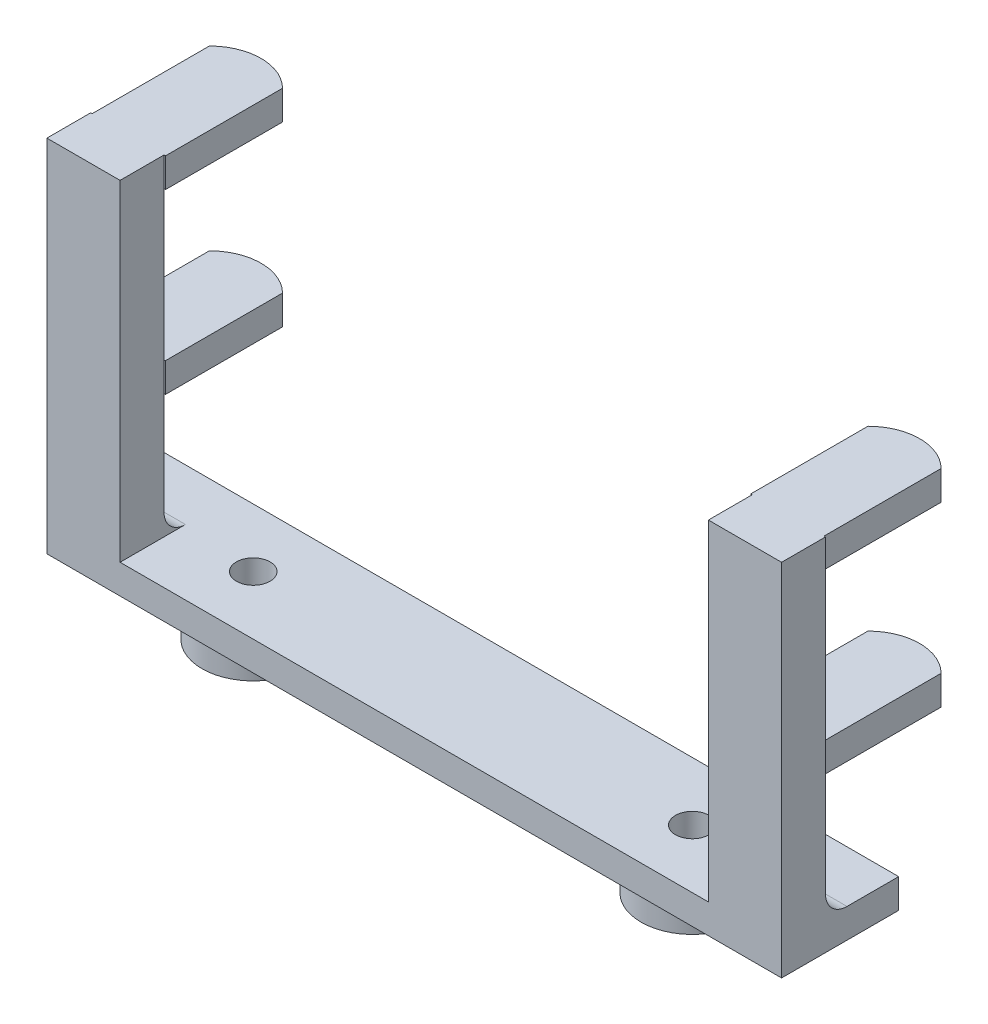
ISO-10303-21;
HEADER;
FILE_DESCRIPTION(('STEP AP214'),'2;1');
FILE_NAME('part.step','',(''),(''),'','','');
FILE_SCHEMA(('AUTOMOTIVE_DESIGN { 1 0 10303 214 1 1 1 1 }'));
ENDSEC;
DATA;
#1=APPLICATION_CONTEXT('core data for automotive mechanical design processes');
#2=APPLICATION_PROTOCOL_DEFINITION('international standard','automotive_design',2000,#1);
#3=PRODUCT_CONTEXT('',#1,'mechanical');
#4=PRODUCT('Part','Part','',(#3));
#5=PRODUCT_RELATED_PRODUCT_CATEGORY('part','',(#4));
#6=PRODUCT_DEFINITION_FORMATION('','',#4);
#7=PRODUCT_DEFINITION_CONTEXT('part definition',#1,'design');
#8=PRODUCT_DEFINITION('design','',#6,#7);
#9=PRODUCT_DEFINITION_SHAPE('','',#8);
#10=(LENGTH_UNIT() NAMED_UNIT(*) SI_UNIT(.MILLI.,.METRE.));
#11=(NAMED_UNIT(*) PLANE_ANGLE_UNIT() SI_UNIT($,.RADIAN.));
#12=(NAMED_UNIT(*) SI_UNIT($,.STERADIAN.) SOLID_ANGLE_UNIT());
#13=UNCERTAINTY_MEASURE_WITH_UNIT(LENGTH_MEASURE(1.E-05),#10,'distance_accuracy_value','');
#14=(GEOMETRIC_REPRESENTATION_CONTEXT(3) GLOBAL_UNCERTAINTY_ASSIGNED_CONTEXT((#13)) GLOBAL_UNIT_ASSIGNED_CONTEXT((#10,
#11,#12)) REPRESENTATION_CONTEXT('',''));
#15=CARTESIAN_POINT('',(0.,0.,0.));
#16=DIRECTION('',(0.,0.,1.));
#17=DIRECTION('',(1.,0.,0.));
#18=AXIS2_PLACEMENT_3D('',#15,#16,#17);
#19=CARTESIAN_POINT('',(-31.877,-2.54000000000001,10.16));
#20=DIRECTION('',(0.,1.,0.));
#21=DIRECTION('',(0.,0.,1.));
#22=AXIS2_PLACEMENT_3D('',#19,#20,#21);
#23=PLANE('',#22);
#24=CARTESIAN_POINT('',(-19.05,-2.54000000000001,5.08));
#25=DIRECTION('',(0.,1.,0.));
#26=DIRECTION('',(0.,0.,1.));
#27=AXIS2_PLACEMENT_3D('',#24,#25,#26);
#28=CIRCLE('',#27,4.445);
#29=CARTESIAN_POINT('',(-19.05,-2.54000000000001,9.525));
#30=VERTEX_POINT('',#29);
#31=EDGE_CURVE('E42',#30,#30,#28,.F.);
#32=ORIENTED_EDGE('',*,*,#31,.F.);
#33=EDGE_LOOP('',(#32));
#34=FACE_BOUND('',#33,.T.);
#35=DIRECTION('',(1.,0.,0.));
#36=VECTOR('',#35,1.);
#37=CARTESIAN_POINT('',(-31.877,-2.54000000000001,0.));
#38=LINE('',#37,#36);
#39=CARTESIAN_POINT('',(-31.877,-2.54000000000001,0.));
#40=VERTEX_POINT('',#39);
#41=CARTESIAN_POINT('',(31.877,-2.54000000000001,0.));
#42=VERTEX_POINT('',#41);
#43=EDGE_CURVE('E442',#40,#42,#38,.T.);
#44=ORIENTED_EDGE('',*,*,#43,.T.);
#45=DIRECTION('',(0.,0.,-1.));
#46=VECTOR('',#45,1.);
#47=CARTESIAN_POINT('',(31.877,-2.54000000000001,10.16));
#48=LINE('',#47,#46);
#49=CARTESIAN_POINT('',(31.877,-2.54000000000001,10.16));
#50=VERTEX_POINT('',#49);
#51=EDGE_CURVE('E458',#50,#42,#48,.T.);
#52=ORIENTED_EDGE('',*,*,#51,.F.);
#53=DIRECTION('',(1.,0.,0.));
#54=VECTOR('',#53,1.);
#55=CARTESIAN_POINT('',(-31.877,-2.54000000000001,10.16));
#56=LINE('',#55,#54);
#57=CARTESIAN_POINT('',(-31.877,-2.54000000000001,10.16));
#58=VERTEX_POINT('',#57);
#59=EDGE_CURVE('E430',#58,#50,#56,.T.);
#60=ORIENTED_EDGE('',*,*,#59,.F.);
#61=DIRECTION('',(0.,0.,-1.));
#62=VECTOR('',#61,1.);
#63=CARTESIAN_POINT('',(-31.877,-2.54000000000001,10.16));
#64=LINE('',#63,#62);
#65=EDGE_CURVE('E461',#58,#40,#64,.T.);
#66=ORIENTED_EDGE('',*,*,#65,.T.);
#67=EDGE_LOOP('',(#44,#52,#60,#66));
#68=FACE_BOUND('',#67,.T.);
#69=CARTESIAN_POINT('',(19.05,-2.54000000000001,5.08));
#70=DIRECTION('',(0.,1.,0.));
#71=DIRECTION('',(0.,0.,1.));
#72=AXIS2_PLACEMENT_3D('',#69,#70,#71);
#73=CIRCLE('',#72,4.445);
#74=CARTESIAN_POINT('',(19.05,-2.54000000000001,9.525));
#75=VERTEX_POINT('',#74);
#76=EDGE_CURVE('E11',#75,#75,#73,.F.);
#77=ORIENTED_EDGE('',*,*,#76,.F.);
#78=EDGE_LOOP('',(#77));
#79=FACE_BOUND('',#78,.T.);
#80=ADVANCED_FACE('F34',(#34,#68,#79),#23,.F.);
#81=CARTESIAN_POINT('',(-31.877,28.702,6.35));
#82=DIRECTION('',(0.,0.,1.));
#83=DIRECTION('',(0.,-1.,0.));
#84=AXIS2_PLACEMENT_3D('',#81,#82,#83);
#85=PLANE('',#84);
#86=DIRECTION('',(0.,-1.,0.));
#87=VECTOR('',#86,1.);
#88=CARTESIAN_POINT('',(31.75,13.3096,6.35));
#89=LINE('',#88,#87);
#90=CARTESIAN_POINT('',(31.75,13.3096,6.35));
#91=VERTEX_POINT('',#90);
#92=CARTESIAN_POINT('',(31.75,10.7696,6.35));
#93=VERTEX_POINT('',#92);
#94=EDGE_CURVE('E279',#91,#93,#89,.T.);
#95=ORIENTED_EDGE('',*,*,#94,.F.);
#96=DIRECTION('',(-1.,0.,0.));
#97=VECTOR('',#96,1.);
#98=CARTESIAN_POINT('',(31.75,13.3096,6.35));
#99=LINE('',#98,#97);
#100=CARTESIAN_POINT('',(25.527,13.3096,6.35));
#101=VERTEX_POINT('',#100);
#102=EDGE_CURVE('E249',#91,#101,#99,.T.);
#103=ORIENTED_EDGE('',*,*,#102,.T.);
#104=DIRECTION('',(0.,-1.,0.));
#105=VECTOR('',#104,1.);
#106=CARTESIAN_POINT('',(25.527,0.,6.35));
#107=LINE('',#106,#105);
#108=CARTESIAN_POINT('',(25.527,26.162,6.35));
#109=VERTEX_POINT('',#108);
#110=EDGE_CURVE('E473',#109,#101,#107,.T.);
#111=ORIENTED_EDGE('',*,*,#110,.F.);
#112=DIRECTION('',(-1.,0.,0.));
#113=VECTOR('',#112,1.);
#114=CARTESIAN_POINT('',(31.75,26.162,6.35));
#115=LINE('',#114,#113);
#116=CARTESIAN_POINT('',(31.75,26.162,6.35));
#117=VERTEX_POINT('',#116);
#118=EDGE_CURVE('E57',#117,#109,#115,.T.);
#119=ORIENTED_EDGE('',*,*,#118,.F.);
#120=DIRECTION('',(0.,1.,0.));
#121=VECTOR('',#120,1.);
#122=CARTESIAN_POINT('',(31.75,26.162,6.35));
#123=LINE('',#122,#121);
#124=CARTESIAN_POINT('',(31.75,28.702,6.35));
#125=VERTEX_POINT('',#124);
#126=EDGE_CURVE('E293',#117,#125,#123,.T.);
#127=ORIENTED_EDGE('',*,*,#126,.T.);
#128=DIRECTION('',(1.,0.,0.));
#129=VECTOR('',#128,1.);
#130=CARTESIAN_POINT('',(-31.877,28.702,6.35));
#131=LINE('',#130,#129);
#132=CARTESIAN_POINT('',(31.877,28.702,6.35));
#133=VERTEX_POINT('',#132);
#134=EDGE_CURVE('E389',#125,#133,#131,.T.);
#135=ORIENTED_EDGE('',*,*,#134,.T.);
#136=DIRECTION('',(0.,-1.,0.));
#137=VECTOR('',#136,1.);
#138=CARTESIAN_POINT('',(31.877,28.702,6.35));
#139=LINE('',#138,#137);
#140=CARTESIAN_POINT('',(31.877,1.86741665164273,6.35));
#141=VERTEX_POINT('',#140);
#142=EDGE_CURVE('E390',#133,#141,#139,.T.);
#143=ORIENTED_EDGE('',*,*,#142,.T.);
#144=DIRECTION('',(1.,0.,0.));
#145=VECTOR('',#144,1.);
#146=CARTESIAN_POINT('',(-31.877,1.86741665164274,6.35));
#147=LINE('',#146,#145);
#148=CARTESIAN_POINT('',(25.527,1.86741665164273,6.35));
#149=VERTEX_POINT('',#148);
#150=EDGE_CURVE('E407',#149,#141,#147,.T.);
#151=ORIENTED_EDGE('',*,*,#150,.F.);
#152=CARTESIAN_POINT('',(25.527,10.7696,6.35));
#153=VERTEX_POINT('',#152);
#154=EDGE_CURVE('E469',#153,#149,#107,.T.);
#155=ORIENTED_EDGE('',*,*,#154,.F.);
#156=DIRECTION('',(-1.,0.,0.));
#157=VECTOR('',#156,1.);
#158=CARTESIAN_POINT('',(31.75,10.7696,6.35));
#159=LINE('',#158,#157);
#160=EDGE_CURVE('E49',#93,#153,#159,.T.);
#161=ORIENTED_EDGE('',*,*,#160,.F.);
#162=EDGE_LOOP('',(#95,#103,#111,#119,#127,#135,#143,#151,#155,#161));
#163=FACE_BOUND('',#162,.T.);
#164=ADVANCED_FACE('F484',(#163),#85,.F.);
#165=CARTESIAN_POINT('',(-25.527,0.,10.16));
#166=DIRECTION('',(-1.,0.,0.));
#167=DIRECTION('',(0.,0.,1.));
#168=AXIS2_PLACEMENT_3D('',#165,#166,#167);
#169=PLANE('',#168);
#170=DIRECTION('',(0.,0.,-1.));
#171=VECTOR('',#170,1.);
#172=CARTESIAN_POINT('',(-25.527,0.,10.16));
#173=LINE('',#172,#171);
#174=CARTESIAN_POINT('',(-25.527,0.,10.16));
#175=VERTEX_POINT('',#174);
#176=CARTESIAN_POINT('',(-25.527,0.,4.48258334835726));
#177=VERTEX_POINT('',#176);
#178=EDGE_CURVE('E440',#175,#177,#173,.T.);
#179=ORIENTED_EDGE('',*,*,#178,.T.);
#180=CARTESIAN_POINT('',(-25.527,1.86741665164274,4.48258334835726));
#181=DIRECTION('',(-1.,0.,0.));
#182=DIRECTION('',(0.,0.,1.));
#183=AXIS2_PLACEMENT_3D('',#180,#181,#182);
#184=CIRCLE('',#183,1.86741665164274);
#185=CARTESIAN_POINT('',(-25.527,1.86741665164274,6.35));
#186=VERTEX_POINT('',#185);
#187=EDGE_CURVE('E412',#177,#186,#184,.T.);
#188=ORIENTED_EDGE('',*,*,#187,.T.);
#189=DIRECTION('',(0.,1.,0.));
#190=VECTOR('',#189,1.);
#191=CARTESIAN_POINT('',(-25.527,0.,6.35));
#192=LINE('',#191,#190);
#193=CARTESIAN_POINT('',(-25.527,10.7696,6.35));
#194=VERTEX_POINT('',#193);
#195=EDGE_CURVE('E416',#186,#194,#192,.T.);
#196=ORIENTED_EDGE('',*,*,#195,.T.);
#197=CARTESIAN_POINT('',(-25.527,13.3096,6.35));
#198=VERTEX_POINT('',#197);
#199=EDGE_CURVE('E420',#194,#198,#192,.T.);
#200=ORIENTED_EDGE('',*,*,#199,.T.);
#201=CARTESIAN_POINT('',(-25.527,26.162,6.35));
#202=VERTEX_POINT('',#201);
#203=EDGE_CURVE('E421',#198,#202,#192,.T.);
#204=ORIENTED_EDGE('',*,*,#203,.T.);
#205=CARTESIAN_POINT('',(-25.527,28.702,6.35));
#206=VERTEX_POINT('',#205);
#207=EDGE_CURVE('E415',#202,#206,#192,.T.);
#208=ORIENTED_EDGE('',*,*,#207,.T.);
#209=DIRECTION('',(0.,0.,-1.));
#210=VECTOR('',#209,1.);
#211=CARTESIAN_POINT('',(-25.527,28.702,10.16));
#212=LINE('',#211,#210);
#213=CARTESIAN_POINT('',(-25.527,28.702,10.16));
#214=VERTEX_POINT('',#213);
#215=EDGE_CURVE('E467',#214,#206,#212,.T.);
#216=ORIENTED_EDGE('',*,*,#215,.F.);
#217=DIRECTION('',(0.,1.,0.));
#218=VECTOR('',#217,1.);
#219=CARTESIAN_POINT('',(-25.527,0.,10.16));
#220=LINE('',#219,#218);
#221=EDGE_CURVE('E422',#175,#214,#220,.T.);
#222=ORIENTED_EDGE('',*,*,#221,.F.);
#223=EDGE_LOOP('',(#179,#188,#196,#200,#204,#208,#216,#222));
#224=FACE_BOUND('',#223,.T.);
#225=ADVANCED_FACE('F36',(#224),#169,.F.);
#226=CARTESIAN_POINT('',(-25.527,28.702,10.16));
#227=DIRECTION('',(0.,-1.,0.));
#228=DIRECTION('',(0.,0.,-1.));
#229=AXIS2_PLACEMENT_3D('',#226,#227,#228);
#230=PLANE('',#229);
#231=ORIENTED_EDGE('',*,*,#215,.T.);
#232=DIRECTION('',(1.,0.,0.));
#233=VECTOR('',#232,1.);
#234=CARTESIAN_POINT('',(-31.75,28.702,6.35));
#235=LINE('',#234,#233);
#236=CARTESIAN_POINT('',(-25.4,28.702,6.35));
#237=VERTEX_POINT('',#236);
#238=EDGE_CURVE('E337',#206,#237,#235,.T.);
#239=ORIENTED_EDGE('',*,*,#238,.T.);
#240=DIRECTION('',(0.,0.,-1.));
#241=VECTOR('',#240,1.);
#242=CARTESIAN_POINT('',(-25.4,28.702,6.35));
#243=LINE('',#242,#241);
#244=CARTESIAN_POINT('',(-25.4,28.702,-3.81));
#245=VERTEX_POINT('',#244);
#246=EDGE_CURVE('E360',#237,#245,#243,.T.);
#247=ORIENTED_EDGE('',*,*,#246,.T.);
#248=CARTESIAN_POINT('',(-28.575,28.702,-0.634999999999999));
#249=DIRECTION('',(0.,1.,0.));
#250=DIRECTION('',(0.,0.,-1.));
#251=AXIS2_PLACEMENT_3D('',#248,#249,#250);
#252=CIRCLE('',#251,4.49012806053458);
#253=CARTESIAN_POINT('',(-31.75,28.702,-3.81));
#254=VERTEX_POINT('',#253);
#255=EDGE_CURVE('E363',#245,#254,#252,.T.);
#256=ORIENTED_EDGE('',*,*,#255,.T.);
#257=DIRECTION('',(0.,0.,1.));
#258=VECTOR('',#257,1.);
#259=CARTESIAN_POINT('',(-31.75,28.702,6.35));
#260=LINE('',#259,#258);
#261=CARTESIAN_POINT('',(-31.75,28.702,6.35));
#262=VERTEX_POINT('',#261);
#263=EDGE_CURVE('E366',#254,#262,#260,.T.);
#264=ORIENTED_EDGE('',*,*,#263,.T.);
#265=CARTESIAN_POINT('',(-31.877,28.702,6.35));
#266=VERTEX_POINT('',#265);
#267=EDGE_CURVE('E408',#266,#262,#131,.T.);
#268=ORIENTED_EDGE('',*,*,#267,.F.);
#269=DIRECTION('',(0.,0.,-1.));
#270=VECTOR('',#269,1.);
#271=CARTESIAN_POINT('',(-31.877,28.702,10.16));
#272=LINE('',#271,#270);
#273=CARTESIAN_POINT('',(-31.877,28.702,10.16));
#274=VERTEX_POINT('',#273);
#275=EDGE_CURVE('E464',#274,#266,#272,.T.);
#276=ORIENTED_EDGE('',*,*,#275,.F.);
#277=DIRECTION('',(-1.,0.,0.));
#278=VECTOR('',#277,1.);
#279=CARTESIAN_POINT('',(-25.527,28.702,10.16));
#280=LINE('',#279,#278);
#281=EDGE_CURVE('E425',#214,#274,#280,.T.);
#282=ORIENTED_EDGE('',*,*,#281,.F.);
#283=EDGE_LOOP('',(#231,#239,#247,#256,#264,#268,#276,#282));
#284=FACE_BOUND('',#283,.T.);
#285=ADVANCED_FACE('F634',(#284),#230,.F.);
#286=CARTESIAN_POINT('',(-31.877,28.702,10.16));
#287=DIRECTION('',(1.,0.,0.));
#288=DIRECTION('',(0.,1.,0.));
#289=AXIS2_PLACEMENT_3D('',#286,#287,#288);
#290=PLANE('',#289);
#291=CARTESIAN_POINT('',(-31.877,1.86741665164274,4.48258334835726));
#292=DIRECTION('',(1.,0.,0.));
#293=DIRECTION('',(0.,1.,0.));
#294=AXIS2_PLACEMENT_3D('',#291,#292,#293);
#295=CIRCLE('',#294,1.86741665164274);
#296=CARTESIAN_POINT('',(-31.877,1.86741665164274,6.35));
#297=VERTEX_POINT('',#296);
#298=CARTESIAN_POINT('',(-31.877,0.,4.48258334835726));
#299=VERTEX_POINT('',#298);
#300=EDGE_CURVE('E382',#297,#299,#295,.T.);
#301=ORIENTED_EDGE('',*,*,#300,.T.);
#302=DIRECTION('',(0.,0.,-1.));
#303=VECTOR('',#302,1.);
#304=CARTESIAN_POINT('',(-31.877,0.,4.48258334835726));
#305=LINE('',#304,#303);
#306=CARTESIAN_POINT('',(-31.877,0.,0.));
#307=VERTEX_POINT('',#306);
#308=EDGE_CURVE('E386',#299,#307,#305,.T.);
#309=ORIENTED_EDGE('',*,*,#308,.T.);
#310=DIRECTION('',(0.,-1.,0.));
#311=VECTOR('',#310,1.);
#312=CARTESIAN_POINT('',(-31.877,28.702,0.));
#313=LINE('',#312,#311);
#314=EDGE_CURVE('E419',#307,#40,#313,.T.);
#315=ORIENTED_EDGE('',*,*,#314,.T.);
#316=ORIENTED_EDGE('',*,*,#65,.F.);
#317=DIRECTION('',(0.,-1.,0.));
#318=VECTOR('',#317,1.);
#319=CARTESIAN_POINT('',(-31.877,28.702,10.16));
#320=LINE('',#319,#318);
#321=EDGE_CURVE('E428',#274,#58,#320,.T.);
#322=ORIENTED_EDGE('',*,*,#321,.F.);
#323=ORIENTED_EDGE('',*,*,#275,.T.);
#324=DIRECTION('',(0.,-1.,0.));
#325=VECTOR('',#324,1.);
#326=CARTESIAN_POINT('',(-31.877,28.702,6.35));
#327=LINE('',#326,#325);
#328=EDGE_CURVE('E379',#266,#297,#327,.T.);
#329=ORIENTED_EDGE('',*,*,#328,.T.);
#330=EDGE_LOOP('',(#301,#309,#315,#316,#322,#323,#329));
#331=FACE_BOUND('',#330,.T.);
#332=ADVANCED_FACE('F630',(#331),#290,.F.);
#333=CARTESIAN_POINT('',(31.877,28.702,10.16));
#334=DIRECTION('',(-1.,0.,0.));
#335=DIRECTION('',(0.,-1.,0.));
#336=AXIS2_PLACEMENT_3D('',#333,#334,#335);
#337=PLANE('',#336);
#338=DIRECTION('',(0.,1.,0.));
#339=VECTOR('',#338,1.);
#340=CARTESIAN_POINT('',(31.877,28.702,0.));
#341=LINE('',#340,#339);
#342=CARTESIAN_POINT('',(31.877,0.,0.));
#343=VERTEX_POINT('',#342);
#344=EDGE_CURVE('E444',#42,#343,#341,.T.);
#345=ORIENTED_EDGE('',*,*,#344,.T.);
#346=DIRECTION('',(0.,0.,-1.));
#347=VECTOR('',#346,1.);
#348=CARTESIAN_POINT('',(31.877,0.,4.48258334835726));
#349=LINE('',#348,#347);
#350=CARTESIAN_POINT('',(31.877,0.,4.48258334835726));
#351=VERTEX_POINT('',#350);
#352=EDGE_CURVE('E383',#351,#343,#349,.T.);
#353=ORIENTED_EDGE('',*,*,#352,.F.);
#354=CARTESIAN_POINT('',(31.877,1.86741665164273,4.48258334835726));
#355=DIRECTION('',(1.,0.,0.));
#356=DIRECTION('',(0.,1.,0.));
#357=AXIS2_PLACEMENT_3D('',#354,#355,#356);
#358=CIRCLE('',#357,1.86741665164274);
#359=EDGE_CURVE('E393',#141,#351,#358,.T.);
#360=ORIENTED_EDGE('',*,*,#359,.F.);
#361=ORIENTED_EDGE('',*,*,#142,.F.);
#362=DIRECTION('',(0.,0.,-1.));
#363=VECTOR('',#362,1.);
#364=CARTESIAN_POINT('',(31.877,28.702,10.16));
#365=LINE('',#364,#363);
#366=CARTESIAN_POINT('',(31.877,28.702,10.16));
#367=VERTEX_POINT('',#366);
#368=EDGE_CURVE('E455',#367,#133,#365,.T.);
#369=ORIENTED_EDGE('',*,*,#368,.F.);
#370=DIRECTION('',(0.,1.,0.));
#371=VECTOR('',#370,1.);
#372=CARTESIAN_POINT('',(31.877,28.702,10.16));
#373=LINE('',#372,#371);
#374=EDGE_CURVE('E432',#50,#367,#373,.T.);
#375=ORIENTED_EDGE('',*,*,#374,.F.);
#376=ORIENTED_EDGE('',*,*,#51,.T.);
#377=EDGE_LOOP('',(#345,#353,#360,#361,#369,#375,#376));
#378=FACE_BOUND('',#377,.T.);
#379=ADVANCED_FACE('F627',(#378),#337,.F.);
#380=CARTESIAN_POINT('',(25.527,28.702,10.16));
#381=DIRECTION('',(0.,-1.,0.));
#382=DIRECTION('',(0.,0.,-1.));
#383=AXIS2_PLACEMENT_3D('',#380,#381,#382);
#384=PLANE('',#383);
#385=ORIENTED_EDGE('',*,*,#368,.T.);
#386=ORIENTED_EDGE('',*,*,#134,.F.);
#387=DIRECTION('',(0.,0.,1.));
#388=VECTOR('',#387,1.);
#389=CARTESIAN_POINT('',(31.75,28.702,6.35));
#390=LINE('',#389,#388);
#391=CARTESIAN_POINT('',(31.75,28.702,-3.81));
#392=VERTEX_POINT('',#391);
#393=EDGE_CURVE('E295',#392,#125,#390,.T.);
#394=ORIENTED_EDGE('',*,*,#393,.F.);
#395=CARTESIAN_POINT('',(28.575,28.702,-0.634999999999999));
#396=DIRECTION('',(0.,-1.,0.));
#397=DIRECTION('',(0.,0.,-1.));
#398=AXIS2_PLACEMENT_3D('',#395,#396,#397);
#399=CIRCLE('',#398,4.49012806053458);
#400=CARTESIAN_POINT('',(25.4,28.702,-3.81));
#401=VERTEX_POINT('',#400);
#402=EDGE_CURVE('E298',#401,#392,#399,.T.);
#403=ORIENTED_EDGE('',*,*,#402,.F.);
#404=DIRECTION('',(0.,0.,-1.));
#405=VECTOR('',#404,1.);
#406=CARTESIAN_POINT('',(25.4,28.702,6.35));
#407=LINE('',#406,#405);
#408=CARTESIAN_POINT('',(25.4,28.702,6.35));
#409=VERTEX_POINT('',#408);
#410=EDGE_CURVE('E300',#409,#401,#407,.T.);
#411=ORIENTED_EDGE('',*,*,#410,.F.);
#412=DIRECTION('',(-1.,0.,0.));
#413=VECTOR('',#412,1.);
#414=CARTESIAN_POINT('',(31.75,28.702,6.35));
#415=LINE('',#414,#413);
#416=CARTESIAN_POINT('',(25.527,28.702,6.35));
#417=VERTEX_POINT('',#416);
#418=EDGE_CURVE('E281',#417,#409,#415,.T.);
#419=ORIENTED_EDGE('',*,*,#418,.F.);
#420=DIRECTION('',(0.,0.,-1.));
#421=VECTOR('',#420,1.);
#422=CARTESIAN_POINT('',(25.527,28.702,10.16));
#423=LINE('',#422,#421);
#424=CARTESIAN_POINT('',(25.527,28.702,10.16));
#425=VERTEX_POINT('',#424);
#426=EDGE_CURVE('E453',#425,#417,#423,.T.);
#427=ORIENTED_EDGE('',*,*,#426,.F.);
#428=DIRECTION('',(-1.,0.,0.));
#429=VECTOR('',#428,1.);
#430=CARTESIAN_POINT('',(25.527,28.702,10.16));
#431=LINE('',#430,#429);
#432=EDGE_CURVE('E434',#367,#425,#431,.T.);
#433=ORIENTED_EDGE('',*,*,#432,.F.);
#434=EDGE_LOOP('',(#385,#386,#394,#403,#411,#419,#427,#433));
#435=FACE_BOUND('',#434,.T.);
#436=ADVANCED_FACE('F623',(#435),#384,.F.);
#437=CARTESIAN_POINT('',(25.527,0.,10.16));
#438=DIRECTION('',(1.,0.,0.));
#439=DIRECTION('',(0.,0.,-1.));
#440=AXIS2_PLACEMENT_3D('',#437,#438,#439);
#441=PLANE('',#440);
#442=EDGE_CURVE('E470',#417,#109,#107,.T.);
#443=ORIENTED_EDGE('',*,*,#442,.T.);
#444=ORIENTED_EDGE('',*,*,#110,.T.);
#445=EDGE_CURVE('E245',#101,#153,#107,.T.);
#446=ORIENTED_EDGE('',*,*,#445,.T.);
#447=ORIENTED_EDGE('',*,*,#154,.T.);
#448=CARTESIAN_POINT('',(25.527,1.86741665164273,4.48258334835726));
#449=DIRECTION('',(1.,0.,0.));
#450=DIRECTION('',(0.,0.,-1.));
#451=AXIS2_PLACEMENT_3D('',#448,#449,#450);
#452=CIRCLE('',#451,1.86741665164274);
#453=CARTESIAN_POINT('',(25.527,0.,4.48258334835726));
#454=VERTEX_POINT('',#453);
#455=EDGE_CURVE('E402',#149,#454,#452,.T.);
#456=ORIENTED_EDGE('',*,*,#455,.T.);
#457=DIRECTION('',(0.,0.,-1.));
#458=VECTOR('',#457,1.);
#459=CARTESIAN_POINT('',(25.527,0.,10.16));
#460=LINE('',#459,#458);
#461=CARTESIAN_POINT('',(25.527,0.,10.16));
#462=VERTEX_POINT('',#461);
#463=EDGE_CURVE('E450',#462,#454,#460,.T.);
#464=ORIENTED_EDGE('',*,*,#463,.F.);
#465=DIRECTION('',(0.,-1.,0.));
#466=VECTOR('',#465,1.);
#467=CARTESIAN_POINT('',(25.527,0.,10.16));
#468=LINE('',#467,#466);
#469=EDGE_CURVE('E436',#425,#462,#468,.T.);
#470=ORIENTED_EDGE('',*,*,#469,.F.);
#471=ORIENTED_EDGE('',*,*,#426,.T.);
#472=EDGE_LOOP('',(#443,#444,#446,#447,#456,#464,#470,#471));
#473=FACE_BOUND('',#472,.T.);
#474=ADVANCED_FACE('F619',(#473),#441,.F.);
#475=CARTESIAN_POINT('',(25.527,0.,10.16));
#476=DIRECTION('',(0.,-1.,0.));
#477=DIRECTION('',(0.,0.,-1.));
#478=AXIS2_PLACEMENT_3D('',#475,#476,#477);
#479=PLANE('',#478);
#480=CARTESIAN_POINT('',(19.05,0.,5.08));
#481=DIRECTION('',(0.,-1.,0.));
#482=DIRECTION('',(0.,0.,-1.));
#483=AXIS2_PLACEMENT_3D('',#480,#481,#482);
#484=CIRCLE('',#483,1.4605);
#485=CARTESIAN_POINT('',(19.05,0.,3.6195));
#486=VERTEX_POINT('',#485);
#487=EDGE_CURVE('E372',#486,#486,#484,.T.);
#488=ORIENTED_EDGE('',*,*,#487,.T.);
#489=EDGE_LOOP('',(#488));
#490=FACE_BOUND('',#489,.T.);
#491=CARTESIAN_POINT('',(-19.05,0.,5.08));
#492=DIRECTION('',(0.,-1.,0.));
#493=DIRECTION('',(0.,0.,-1.));
#494=AXIS2_PLACEMENT_3D('',#491,#492,#493);
#495=CIRCLE('',#494,1.4605);
#496=CARTESIAN_POINT('',(-19.05,0.,3.6195));
#497=VERTEX_POINT('',#496);
#498=EDGE_CURVE('E394',#497,#497,#495,.T.);
#499=ORIENTED_EDGE('',*,*,#498,.T.);
#500=EDGE_LOOP('',(#499));
#501=FACE_BOUND('',#500,.T.);
#502=DIRECTION('',(-1.,0.,0.));
#503=VECTOR('',#502,1.);
#504=CARTESIAN_POINT('',(25.527,0.,0.));
#505=LINE('',#504,#503);
#506=EDGE_CURVE('E426',#343,#307,#505,.T.);
#507=ORIENTED_EDGE('',*,*,#506,.T.);
#508=ORIENTED_EDGE('',*,*,#308,.F.);
#509=DIRECTION('',(1.,0.,0.));
#510=VECTOR('',#509,1.);
#511=CARTESIAN_POINT('',(-31.877,0.,4.48258334835726));
#512=LINE('',#511,#510);
#513=EDGE_CURVE('E399',#299,#177,#512,.T.);
#514=ORIENTED_EDGE('',*,*,#513,.T.);
#515=ORIENTED_EDGE('',*,*,#178,.F.);
#516=DIRECTION('',(-1.,0.,0.));
#517=VECTOR('',#516,1.);
#518=CARTESIAN_POINT('',(25.527,0.,10.16));
#519=LINE('',#518,#517);
#520=EDGE_CURVE('E438',#462,#175,#519,.T.);
#521=ORIENTED_EDGE('',*,*,#520,.F.);
#522=ORIENTED_EDGE('',*,*,#463,.T.);
#523=EDGE_CURVE('E403',#454,#351,#512,.T.);
#524=ORIENTED_EDGE('',*,*,#523,.T.);
#525=ORIENTED_EDGE('',*,*,#352,.T.);
#526=EDGE_LOOP('',(#507,#508,#514,#515,#521,#522,#524,#525));
#527=FACE_BOUND('',#526,.T.);
#528=ADVANCED_FACE('F612',(#490,#501,#527),#479,.F.);
#529=CARTESIAN_POINT('',(0.,0.,10.16));
#530=DIRECTION('',(0.,0.,1.));
#531=DIRECTION('',(1.,0.,0.));
#532=AXIS2_PLACEMENT_3D('',#529,#530,#531);
#533=PLANE('',#532);
#534=ORIENTED_EDGE('',*,*,#221,.T.);
#535=ORIENTED_EDGE('',*,*,#281,.T.);
#536=ORIENTED_EDGE('',*,*,#321,.T.);
#537=ORIENTED_EDGE('',*,*,#59,.T.);
#538=ORIENTED_EDGE('',*,*,#374,.T.);
#539=ORIENTED_EDGE('',*,*,#432,.T.);
#540=ORIENTED_EDGE('',*,*,#469,.T.);
#541=ORIENTED_EDGE('',*,*,#520,.T.);
#542=EDGE_LOOP('',(#534,#535,#536,#537,#538,#539,#540,#541));
#543=FACE_BOUND('',#542,.T.);
#544=ADVANCED_FACE('F608',(#543),#533,.T.);
#545=CARTESIAN_POINT('',(0.,0.,0.));
#546=DIRECTION('',(0.,0.,1.));
#547=DIRECTION('',(1.,0.,0.));
#548=AXIS2_PLACEMENT_3D('',#545,#546,#547);
#549=PLANE('',#548);
#550=ORIENTED_EDGE('',*,*,#314,.F.);
#551=ORIENTED_EDGE('',*,*,#506,.F.);
#552=ORIENTED_EDGE('',*,*,#344,.F.);
#553=ORIENTED_EDGE('',*,*,#43,.F.);
#554=EDGE_LOOP('',(#550,#551,#552,#553));
#555=FACE_BOUND('',#554,.T.);
#556=ADVANCED_FACE('F611',(#555),#549,.F.);
#557=CARTESIAN_POINT('',(-31.877,1.86741665164274,4.48258334835726));
#558=DIRECTION('',(1.,0.,0.));
#559=DIRECTION('',(0.,1.,0.));
#560=AXIS2_PLACEMENT_3D('',#557,#558,#559);
#561=CYLINDRICAL_SURFACE('',#560,1.86741665164274);
#562=ORIENTED_EDGE('',*,*,#150,.T.);
#563=ORIENTED_EDGE('',*,*,#359,.T.);
#564=ORIENTED_EDGE('',*,*,#523,.F.);
#565=ORIENTED_EDGE('',*,*,#455,.F.);
#566=EDGE_LOOP('',(#562,#563,#564,#565));
#567=FACE_BOUND('',#566,.T.);
#568=ADVANCED_FACE('F604',(#567),#561,.F.);
#569=ORIENTED_EDGE('',*,*,#203,.F.);
#570=DIRECTION('',(1.,0.,0.));
#571=VECTOR('',#570,1.);
#572=CARTESIAN_POINT('',(-31.75,13.3096,6.35));
#573=LINE('',#572,#571);
#574=CARTESIAN_POINT('',(-31.75,13.3096,6.35));
#575=VERTEX_POINT('',#574);
#576=EDGE_CURVE('E313',#575,#198,#573,.T.);
#577=ORIENTED_EDGE('',*,*,#576,.F.);
#578=DIRECTION('',(0.,-1.,0.));
#579=VECTOR('',#578,1.);
#580=CARTESIAN_POINT('',(-31.75,13.3096,6.35));
#581=LINE('',#580,#579);
#582=CARTESIAN_POINT('',(-31.75,10.7696,6.35));
#583=VERTEX_POINT('',#582);
#584=EDGE_CURVE('E324',#575,#583,#581,.T.);
#585=ORIENTED_EDGE('',*,*,#584,.T.);
#586=DIRECTION('',(1.,0.,0.));
#587=VECTOR('',#586,1.);
#588=CARTESIAN_POINT('',(-31.75,10.7696,6.35));
#589=LINE('',#588,#587);
#590=EDGE_CURVE('E325',#583,#194,#589,.T.);
#591=ORIENTED_EDGE('',*,*,#590,.T.);
#592=ORIENTED_EDGE('',*,*,#195,.F.);
#593=EDGE_CURVE('E404',#297,#186,#147,.T.);
#594=ORIENTED_EDGE('',*,*,#593,.F.);
#595=ORIENTED_EDGE('',*,*,#328,.F.);
#596=ORIENTED_EDGE('',*,*,#267,.T.);
#597=DIRECTION('',(0.,1.,0.));
#598=VECTOR('',#597,1.);
#599=CARTESIAN_POINT('',(-31.75,26.162,6.35));
#600=LINE('',#599,#598);
#601=CARTESIAN_POINT('',(-31.75,26.162,6.35));
#602=VERTEX_POINT('',#601);
#603=EDGE_CURVE('E369',#602,#262,#600,.T.);
#604=ORIENTED_EDGE('',*,*,#603,.F.);
#605=DIRECTION('',(1.,0.,0.));
#606=VECTOR('',#605,1.);
#607=CARTESIAN_POINT('',(-31.75,26.162,6.35));
#608=LINE('',#607,#606);
#609=EDGE_CURVE('E345',#602,#202,#608,.T.);
#610=ORIENTED_EDGE('',*,*,#609,.T.);
#611=EDGE_LOOP('',(#569,#577,#585,#591,#592,#594,#595,#596,#604,#610));
#612=FACE_BOUND('',#611,.T.);
#613=ADVANCED_FACE('F602',(#612),#85,.F.);
#614=ORIENTED_EDGE('',*,*,#513,.F.);
#615=ORIENTED_EDGE('',*,*,#300,.F.);
#616=ORIENTED_EDGE('',*,*,#593,.T.);
#617=ORIENTED_EDGE('',*,*,#187,.F.);
#618=EDGE_LOOP('',(#614,#615,#616,#617));
#619=FACE_BOUND('',#618,.T.);
#620=ADVANCED_FACE('F598',(#619),#561,.F.);
#621=CARTESIAN_POINT('',(-19.05,3.80999999999999,5.08));
#622=DIRECTION('',(0.,-1.,0.));
#623=DIRECTION('',(0.,0.,-1.));
#624=AXIS2_PLACEMENT_3D('',#621,#622,#623);
#625=CYLINDRICAL_SURFACE('',#624,1.4605);
#626=ORIENTED_EDGE('',*,*,#498,.F.);
#627=EDGE_LOOP('',(#626));
#628=FACE_BOUND('',#627,.T.);
#629=CARTESIAN_POINT('',(-19.05,-5.08000000000001,5.08));
#630=DIRECTION('',(0.,-1.,0.));
#631=DIRECTION('',(0.,0.,-1.));
#632=AXIS2_PLACEMENT_3D('',#629,#630,#631);
#633=CIRCLE('',#632,1.4605);
#634=CARTESIAN_POINT('',(-19.05,-5.08000000000001,3.6195));
#635=VERTEX_POINT('',#634);
#636=EDGE_CURVE('E715',#635,#635,#633,.T.);
#637=ORIENTED_EDGE('',*,*,#636,.T.);
#638=EDGE_LOOP('',(#637));
#639=FACE_BOUND('',#638,.T.);
#640=ADVANCED_FACE('F594',(#628,#639),#625,.F.);
#641=CARTESIAN_POINT('',(19.05,3.80999999999999,5.08));
#642=DIRECTION('',(0.,-1.,0.));
#643=DIRECTION('',(0.,0.,-1.));
#644=AXIS2_PLACEMENT_3D('',#641,#642,#643);
#645=CYLINDRICAL_SURFACE('',#644,1.4605);
#646=ORIENTED_EDGE('',*,*,#487,.F.);
#647=EDGE_LOOP('',(#646));
#648=FACE_BOUND('',#647,.T.);
#649=CARTESIAN_POINT('',(19.05,-5.08000000000001,5.08));
#650=DIRECTION('',(0.,-1.,0.));
#651=DIRECTION('',(0.,0.,1.));
#652=AXIS2_PLACEMENT_3D('',#649,#650,#651);
#653=CIRCLE('',#652,1.4605);
#654=CARTESIAN_POINT('',(19.05,-5.08000000000001,6.5405));
#655=VERTEX_POINT('',#654);
#656=EDGE_CURVE('E723',#655,#655,#653,.T.);
#657=ORIENTED_EDGE('',*,*,#656,.T.);
#658=EDGE_LOOP('',(#657));
#659=FACE_BOUND('',#658,.T.);
#660=ADVANCED_FACE('F590',(#648,#659),#645,.F.);
#661=CARTESIAN_POINT('',(-31.75,26.162,6.35));
#662=DIRECTION('',(0.,0.,1.));
#663=DIRECTION('',(1.,0.,0.));
#664=AXIS2_PLACEMENT_3D('',#661,#662,#663);
#665=PLANE('',#664);
#666=ORIENTED_EDGE('',*,*,#207,.F.);
#667=CARTESIAN_POINT('',(-25.4,26.162,6.35));
#668=VERTEX_POINT('',#667);
#669=EDGE_CURVE('E349',#202,#668,#608,.T.);
#670=ORIENTED_EDGE('',*,*,#669,.T.);
#671=DIRECTION('',(0.,1.,0.));
#672=VECTOR('',#671,1.);
#673=CARTESIAN_POINT('',(-25.4,26.162,6.35));
#674=LINE('',#673,#672);
#675=EDGE_CURVE('E358',#668,#237,#674,.T.);
#676=ORIENTED_EDGE('',*,*,#675,.T.);
#677=ORIENTED_EDGE('',*,*,#238,.F.);
#678=EDGE_LOOP('',(#666,#670,#676,#677));
#679=FACE_BOUND('',#678,.T.);
#680=ADVANCED_FACE('F580',(#679),#665,.T.);
#681=CARTESIAN_POINT('',(-31.75,26.162,6.35));
#682=DIRECTION('',(-1.,0.,0.));
#683=DIRECTION('',(0.,0.,1.));
#684=AXIS2_PLACEMENT_3D('',#681,#682,#683);
#685=PLANE('',#684);
#686=ORIENTED_EDGE('',*,*,#263,.F.);
#687=DIRECTION('',(0.,1.,0.));
#688=VECTOR('',#687,1.);
#689=CARTESIAN_POINT('',(-31.75,26.162,-3.81));
#690=LINE('',#689,#688);
#691=CARTESIAN_POINT('',(-31.75,26.162,-3.81));
#692=VERTEX_POINT('',#691);
#693=EDGE_CURVE('E373',#692,#254,#690,.T.);
#694=ORIENTED_EDGE('',*,*,#693,.F.);
#695=DIRECTION('',(0.,0.,1.));
#696=VECTOR('',#695,1.);
#697=CARTESIAN_POINT('',(-31.75,26.162,6.35));
#698=LINE('',#697,#696);
#699=EDGE_CURVE('E355',#692,#602,#698,.T.);
#700=ORIENTED_EDGE('',*,*,#699,.T.);
#701=ORIENTED_EDGE('',*,*,#603,.T.);
#702=EDGE_LOOP('',(#686,#694,#700,#701));
#703=FACE_BOUND('',#702,.T.);
#704=ADVANCED_FACE('F576',(#703),#685,.T.);
#705=CARTESIAN_POINT('',(-28.575,26.162,-0.634999999999999));
#706=DIRECTION('',(0.,1.,0.));
#707=DIRECTION('',(0.,0.,1.));
#708=AXIS2_PLACEMENT_3D('',#705,#706,#707);
#709=CYLINDRICAL_SURFACE('',#708,4.49012806053458);
#710=ORIENTED_EDGE('',*,*,#255,.F.);
#711=DIRECTION('',(0.,1.,0.));
#712=VECTOR('',#711,1.);
#713=CARTESIAN_POINT('',(-25.4,26.162,-3.81));
#714=LINE('',#713,#712);
#715=CARTESIAN_POINT('',(-25.4,26.162,-3.81));
#716=VERTEX_POINT('',#715);
#717=EDGE_CURVE('E375',#716,#245,#714,.T.);
#718=ORIENTED_EDGE('',*,*,#717,.F.);
#719=CARTESIAN_POINT('',(-28.575,26.162,-0.634999999999999));
#720=DIRECTION('',(0.,1.,0.));
#721=DIRECTION('',(0.,0.,-1.));
#722=AXIS2_PLACEMENT_3D('',#719,#720,#721);
#723=CIRCLE('',#722,4.49012806053458);
#724=EDGE_CURVE('E352',#716,#692,#723,.T.);
#725=ORIENTED_EDGE('',*,*,#724,.T.);
#726=ORIENTED_EDGE('',*,*,#693,.T.);
#727=EDGE_LOOP('',(#710,#718,#725,#726));
#728=FACE_BOUND('',#727,.T.);
#729=ADVANCED_FACE('F579',(#728),#709,.T.);
#730=CARTESIAN_POINT('',(-25.4,26.162,6.35));
#731=DIRECTION('',(1.,0.,0.));
#732=DIRECTION('',(0.,0.,-1.));
#733=AXIS2_PLACEMENT_3D('',#730,#731,#732);
#734=PLANE('',#733);
#735=ORIENTED_EDGE('',*,*,#246,.F.);
#736=ORIENTED_EDGE('',*,*,#675,.F.);
#737=DIRECTION('',(0.,0.,-1.));
#738=VECTOR('',#737,1.);
#739=CARTESIAN_POINT('',(-25.4,26.162,6.35));
#740=LINE('',#739,#738);
#741=EDGE_CURVE('E348',#668,#716,#740,.T.);
#742=ORIENTED_EDGE('',*,*,#741,.T.);
#743=ORIENTED_EDGE('',*,*,#717,.T.);
#744=EDGE_LOOP('',(#735,#736,#742,#743));
#745=FACE_BOUND('',#744,.T.);
#746=ADVANCED_FACE('F574',(#745),#734,.T.);
#747=CARTESIAN_POINT('',(-28.575,26.162,-0.634999999999999));
#748=DIRECTION('',(0.,-1.,0.));
#749=DIRECTION('',(0.,0.,-1.));
#750=AXIS2_PLACEMENT_3D('',#747,#748,#749);
#751=PLANE('',#750);
#752=ORIENTED_EDGE('',*,*,#609,.F.);
#753=ORIENTED_EDGE('',*,*,#699,.F.);
#754=ORIENTED_EDGE('',*,*,#724,.F.);
#755=ORIENTED_EDGE('',*,*,#741,.F.);
#756=ORIENTED_EDGE('',*,*,#669,.F.);
#757=EDGE_LOOP('',(#752,#753,#754,#755,#756));
#758=FACE_BOUND('',#757,.T.);
#759=ADVANCED_FACE('F570',(#758),#751,.T.);
#760=CARTESIAN_POINT('',(-31.75,13.3096,6.35));
#761=DIRECTION('',(0.,0.,-1.));
#762=DIRECTION('',(-1.,0.,0.));
#763=AXIS2_PLACEMENT_3D('',#760,#761,#762);
#764=PLANE('',#763);
#765=CARTESIAN_POINT('',(-25.4,13.3096,6.35));
#766=VERTEX_POINT('',#765);
#767=EDGE_CURVE('E317',#198,#766,#573,.T.);
#768=ORIENTED_EDGE('',*,*,#767,.F.);
#769=ORIENTED_EDGE('',*,*,#199,.F.);
#770=CARTESIAN_POINT('',(-25.4,10.7696,6.35));
#771=VERTEX_POINT('',#770);
#772=EDGE_CURVE('E305',#194,#771,#589,.T.);
#773=ORIENTED_EDGE('',*,*,#772,.T.);
#774=DIRECTION('',(0.,-1.,0.));
#775=VECTOR('',#774,1.);
#776=CARTESIAN_POINT('',(-25.4,13.3096,6.35));
#777=LINE('',#776,#775);
#778=EDGE_CURVE('E334',#766,#771,#777,.T.);
#779=ORIENTED_EDGE('',*,*,#778,.F.);
#780=EDGE_LOOP('',(#768,#769,#773,#779));
#781=FACE_BOUND('',#780,.T.);
#782=ADVANCED_FACE('F560',(#781),#764,.F.);
#783=CARTESIAN_POINT('',(-25.4,13.3096,6.35));
#784=DIRECTION('',(-1.,0.,0.));
#785=DIRECTION('',(0.,0.,1.));
#786=AXIS2_PLACEMENT_3D('',#783,#784,#785);
#787=PLANE('',#786);
#788=DIRECTION('',(0.,0.,-1.));
#789=VECTOR('',#788,1.);
#790=CARTESIAN_POINT('',(-25.4,10.7696,6.35));
#791=LINE('',#790,#789);
#792=CARTESIAN_POINT('',(-25.4,10.7696,-3.81));
#793=VERTEX_POINT('',#792);
#794=EDGE_CURVE('E332',#771,#793,#791,.T.);
#795=ORIENTED_EDGE('',*,*,#794,.T.);
#796=DIRECTION('',(0.,-1.,0.));
#797=VECTOR('',#796,1.);
#798=CARTESIAN_POINT('',(-25.4,13.3096,-3.81));
#799=LINE('',#798,#797);
#800=CARTESIAN_POINT('',(-25.4,13.3096,-3.81));
#801=VERTEX_POINT('',#800);
#802=EDGE_CURVE('E338',#801,#793,#799,.T.);
#803=ORIENTED_EDGE('',*,*,#802,.F.);
#804=DIRECTION('',(0.,0.,-1.));
#805=VECTOR('',#804,1.);
#806=CARTESIAN_POINT('',(-25.4,13.3096,6.35));
#807=LINE('',#806,#805);
#808=EDGE_CURVE('E322',#766,#801,#807,.T.);
#809=ORIENTED_EDGE('',*,*,#808,.F.);
#810=ORIENTED_EDGE('',*,*,#778,.T.);
#811=EDGE_LOOP('',(#795,#803,#809,#810));
#812=FACE_BOUND('',#811,.T.);
#813=ADVANCED_FACE('F556',(#812),#787,.F.);
#814=CARTESIAN_POINT('',(-28.575,13.3096,-0.634999999999999));
#815=DIRECTION('',(0.,-1.,0.));
#816=DIRECTION('',(0.,0.,-1.));
#817=AXIS2_PLACEMENT_3D('',#814,#815,#816);
#818=CYLINDRICAL_SURFACE('',#817,4.49012806053458);
#819=CARTESIAN_POINT('',(-28.575,10.7696,-0.634999999999999));
#820=DIRECTION('',(0.,1.,0.));
#821=DIRECTION('',(0.,0.,-1.));
#822=AXIS2_PLACEMENT_3D('',#819,#820,#821);
#823=CIRCLE('',#822,4.49012806053458);
#824=CARTESIAN_POINT('',(-31.75,10.7696,-3.81));
#825=VERTEX_POINT('',#824);
#826=EDGE_CURVE('E330',#793,#825,#823,.T.);
#827=ORIENTED_EDGE('',*,*,#826,.T.);
#828=DIRECTION('',(0.,-1.,0.));
#829=VECTOR('',#828,1.);
#830=CARTESIAN_POINT('',(-31.75,13.3096,-3.81));
#831=LINE('',#830,#829);
#832=CARTESIAN_POINT('',(-31.75,13.3096,-3.81));
#833=VERTEX_POINT('',#832);
#834=EDGE_CURVE('E341',#833,#825,#831,.T.);
#835=ORIENTED_EDGE('',*,*,#834,.F.);
#836=CARTESIAN_POINT('',(-28.575,13.3096,-0.634999999999999));
#837=DIRECTION('',(0.,1.,0.));
#838=DIRECTION('',(0.,0.,-1.));
#839=AXIS2_PLACEMENT_3D('',#836,#837,#838);
#840=CIRCLE('',#839,4.49012806053458);
#841=EDGE_CURVE('E320',#801,#833,#840,.T.);
#842=ORIENTED_EDGE('',*,*,#841,.F.);
#843=ORIENTED_EDGE('',*,*,#802,.T.);
#844=EDGE_LOOP('',(#827,#835,#842,#843));
#845=FACE_BOUND('',#844,.T.);
#846=ADVANCED_FACE('F559',(#845),#818,.T.);
#847=CARTESIAN_POINT('',(-31.75,13.3096,6.35));
#848=DIRECTION('',(1.,0.,0.));
#849=DIRECTION('',(0.,0.,-1.));
#850=AXIS2_PLACEMENT_3D('',#847,#848,#849);
#851=PLANE('',#850);
#852=DIRECTION('',(0.,0.,1.));
#853=VECTOR('',#852,1.);
#854=CARTESIAN_POINT('',(-31.75,10.7696,6.35));
#855=LINE('',#854,#853);
#856=EDGE_CURVE('E327',#825,#583,#855,.T.);
#857=ORIENTED_EDGE('',*,*,#856,.T.);
#858=ORIENTED_EDGE('',*,*,#584,.F.);
#859=DIRECTION('',(0.,0.,1.));
#860=VECTOR('',#859,1.);
#861=CARTESIAN_POINT('',(-31.75,13.3096,6.35));
#862=LINE('',#861,#860);
#863=EDGE_CURVE('E316',#833,#575,#862,.T.);
#864=ORIENTED_EDGE('',*,*,#863,.F.);
#865=ORIENTED_EDGE('',*,*,#834,.T.);
#866=EDGE_LOOP('',(#857,#858,#864,#865));
#867=FACE_BOUND('',#866,.T.);
#868=ADVANCED_FACE('F551',(#867),#851,.F.);
#869=CARTESIAN_POINT('',(-28.575,13.3096,-0.634999999999999));
#870=DIRECTION('',(0.,1.,0.));
#871=DIRECTION('',(0.,0.,-1.));
#872=AXIS2_PLACEMENT_3D('',#869,#870,#871);
#873=PLANE('',#872);
#874=ORIENTED_EDGE('',*,*,#576,.T.);
#875=ORIENTED_EDGE('',*,*,#767,.T.);
#876=ORIENTED_EDGE('',*,*,#808,.T.);
#877=ORIENTED_EDGE('',*,*,#841,.T.);
#878=ORIENTED_EDGE('',*,*,#863,.T.);
#879=EDGE_LOOP('',(#874,#875,#876,#877,#878));
#880=FACE_BOUND('',#879,.T.);
#881=ADVANCED_FACE('F548',(#880),#873,.T.);
#882=CARTESIAN_POINT('',(-28.575,10.7696,-0.634999999999999));
#883=DIRECTION('',(0.,1.,0.));
#884=DIRECTION('',(0.,0.,-1.));
#885=AXIS2_PLACEMENT_3D('',#882,#883,#884);
#886=PLANE('',#885);
#887=ORIENTED_EDGE('',*,*,#590,.F.);
#888=ORIENTED_EDGE('',*,*,#856,.F.);
#889=ORIENTED_EDGE('',*,*,#826,.F.);
#890=ORIENTED_EDGE('',*,*,#794,.F.);
#891=ORIENTED_EDGE('',*,*,#772,.F.);
#892=EDGE_LOOP('',(#887,#888,#889,#890,#891));
#893=FACE_BOUND('',#892,.T.);
#894=ADVANCED_FACE('F546',(#893),#886,.F.);
#895=CARTESIAN_POINT('',(31.75,26.162,6.35));
#896=DIRECTION('',(0.,0.,-1.));
#897=DIRECTION('',(-1.,0.,0.));
#898=AXIS2_PLACEMENT_3D('',#895,#896,#897);
#899=PLANE('',#898);
#900=CARTESIAN_POINT('',(25.4,26.162,6.35));
#901=VERTEX_POINT('',#900);
#902=EDGE_CURVE('E287',#109,#901,#115,.T.);
#903=ORIENTED_EDGE('',*,*,#902,.F.);
#904=ORIENTED_EDGE('',*,*,#442,.F.);
#905=ORIENTED_EDGE('',*,*,#418,.T.);
#906=DIRECTION('',(0.,1.,0.));
#907=VECTOR('',#906,1.);
#908=CARTESIAN_POINT('',(25.4,26.162,6.35));
#909=LINE('',#908,#907);
#910=EDGE_CURVE('E302',#901,#409,#909,.T.);
#911=ORIENTED_EDGE('',*,*,#910,.F.);
#912=EDGE_LOOP('',(#903,#904,#905,#911));
#913=FACE_BOUND('',#912,.T.);
#914=ADVANCED_FACE('F536',(#913),#899,.F.);
#915=CARTESIAN_POINT('',(25.4,26.162,6.35));
#916=DIRECTION('',(1.,0.,0.));
#917=DIRECTION('',(0.,0.,-1.));
#918=AXIS2_PLACEMENT_3D('',#915,#916,#917);
#919=PLANE('',#918);
#920=ORIENTED_EDGE('',*,*,#410,.T.);
#921=DIRECTION('',(0.,1.,0.));
#922=VECTOR('',#921,1.);
#923=CARTESIAN_POINT('',(25.4,26.162,-3.81));
#924=LINE('',#923,#922);
#925=CARTESIAN_POINT('',(25.4,26.162,-3.81));
#926=VERTEX_POINT('',#925);
#927=EDGE_CURVE('E306',#926,#401,#924,.T.);
#928=ORIENTED_EDGE('',*,*,#927,.F.);
#929=DIRECTION('',(0.,0.,-1.));
#930=VECTOR('',#929,1.);
#931=CARTESIAN_POINT('',(25.4,26.162,6.35));
#932=LINE('',#931,#930);
#933=EDGE_CURVE('E291',#901,#926,#932,.T.);
#934=ORIENTED_EDGE('',*,*,#933,.F.);
#935=ORIENTED_EDGE('',*,*,#910,.T.);
#936=EDGE_LOOP('',(#920,#928,#934,#935));
#937=FACE_BOUND('',#936,.T.);
#938=ADVANCED_FACE('F532',(#937),#919,.F.);
#939=CARTESIAN_POINT('',(28.575,26.162,-0.634999999999999));
#940=DIRECTION('',(0.,1.,0.));
#941=DIRECTION('',(0.,0.,1.));
#942=AXIS2_PLACEMENT_3D('',#939,#940,#941);
#943=CYLINDRICAL_SURFACE('',#942,4.49012806053458);
#944=ORIENTED_EDGE('',*,*,#402,.T.);
#945=DIRECTION('',(0.,1.,0.));
#946=VECTOR('',#945,1.);
#947=CARTESIAN_POINT('',(31.75,26.162,-3.81));
#948=LINE('',#947,#946);
#949=CARTESIAN_POINT('',(31.75,26.162,-3.81));
#950=VERTEX_POINT('',#949);
#951=EDGE_CURVE('E309',#950,#392,#948,.T.);
#952=ORIENTED_EDGE('',*,*,#951,.F.);
#953=CARTESIAN_POINT('',(28.575,26.162,-0.634999999999999));
#954=DIRECTION('',(0.,-1.,0.));
#955=DIRECTION('',(0.,0.,-1.));
#956=AXIS2_PLACEMENT_3D('',#953,#954,#955);
#957=CIRCLE('',#956,4.49012806053458);
#958=EDGE_CURVE('E289',#926,#950,#957,.T.);
#959=ORIENTED_EDGE('',*,*,#958,.F.);
#960=ORIENTED_EDGE('',*,*,#927,.T.);
#961=EDGE_LOOP('',(#944,#952,#959,#960));
#962=FACE_BOUND('',#961,.T.);
#963=ADVANCED_FACE('F535',(#962),#943,.T.);
#964=CARTESIAN_POINT('',(31.75,26.162,6.35));
#965=DIRECTION('',(-1.,0.,0.));
#966=DIRECTION('',(0.,0.,1.));
#967=AXIS2_PLACEMENT_3D('',#964,#965,#966);
#968=PLANE('',#967);
#969=ORIENTED_EDGE('',*,*,#393,.T.);
#970=ORIENTED_EDGE('',*,*,#126,.F.);
#971=DIRECTION('',(0.,0.,1.));
#972=VECTOR('',#971,1.);
#973=CARTESIAN_POINT('',(31.75,26.162,6.35));
#974=LINE('',#973,#972);
#975=EDGE_CURVE('E286',#950,#117,#974,.T.);
#976=ORIENTED_EDGE('',*,*,#975,.F.);
#977=ORIENTED_EDGE('',*,*,#951,.T.);
#978=EDGE_LOOP('',(#969,#970,#976,#977));
#979=FACE_BOUND('',#978,.T.);
#980=ADVANCED_FACE('F530',(#979),#968,.F.);
#981=CARTESIAN_POINT('',(28.575,26.162,-0.634999999999999));
#982=DIRECTION('',(0.,-1.,0.));
#983=DIRECTION('',(0.,0.,-1.));
#984=AXIS2_PLACEMENT_3D('',#981,#982,#983);
#985=PLANE('',#984);
#986=ORIENTED_EDGE('',*,*,#118,.T.);
#987=ORIENTED_EDGE('',*,*,#902,.T.);
#988=ORIENTED_EDGE('',*,*,#933,.T.);
#989=ORIENTED_EDGE('',*,*,#958,.T.);
#990=ORIENTED_EDGE('',*,*,#975,.T.);
#991=EDGE_LOOP('',(#986,#987,#988,#989,#990));
#992=FACE_BOUND('',#991,.T.);
#993=ADVANCED_FACE('F527',(#992),#985,.T.);
#994=CARTESIAN_POINT('',(31.75,13.3096,6.35));
#995=DIRECTION('',(0.,0.,1.));
#996=DIRECTION('',(1.,0.,0.));
#997=AXIS2_PLACEMENT_3D('',#994,#995,#996);
#998=PLANE('',#997);
#999=ORIENTED_EDGE('',*,*,#445,.F.);
#1000=CARTESIAN_POINT('',(25.4,13.3096,6.35));
#1001=VERTEX_POINT('',#1000);
#1002=EDGE_CURVE('E239',#101,#1001,#99,.T.);
#1003=ORIENTED_EDGE('',*,*,#1002,.T.);
#1004=DIRECTION('',(0.,-1.,0.));
#1005=VECTOR('',#1004,1.);
#1006=CARTESIAN_POINT('',(25.4,13.3096,6.35));
#1007=LINE('',#1006,#1005);
#1008=CARTESIAN_POINT('',(25.4,10.7696,6.35));
#1009=VERTEX_POINT('',#1008);
#1010=EDGE_CURVE('E242',#1001,#1009,#1007,.T.);
#1011=ORIENTED_EDGE('',*,*,#1010,.T.);
#1012=EDGE_CURVE('E273',#153,#1009,#159,.T.);
#1013=ORIENTED_EDGE('',*,*,#1012,.F.);
#1014=EDGE_LOOP('',(#999,#1003,#1011,#1013));
#1015=FACE_BOUND('',#1014,.T.);
#1016=ADVANCED_FACE('F241',(#1015),#998,.T.);
#1017=CARTESIAN_POINT('',(31.75,13.3096,6.35));
#1018=DIRECTION('',(1.,0.,0.));
#1019=DIRECTION('',(0.,0.,-1.));
#1020=AXIS2_PLACEMENT_3D('',#1017,#1018,#1019);
#1021=PLANE('',#1020);
#1022=DIRECTION('',(0.,0.,1.));
#1023=VECTOR('',#1022,1.);
#1024=CARTESIAN_POINT('',(31.75,10.7696,6.35));
#1025=LINE('',#1024,#1023);
#1026=CARTESIAN_POINT('',(31.75,10.7696,-3.81));
#1027=VERTEX_POINT('',#1026);
#1028=EDGE_CURVE('E250',#1027,#93,#1025,.T.);
#1029=ORIENTED_EDGE('',*,*,#1028,.F.);
#1030=DIRECTION('',(0.,-1.,0.));
#1031=VECTOR('',#1030,1.);
#1032=CARTESIAN_POINT('',(31.75,13.3096,-3.81));
#1033=LINE('',#1032,#1031);
#1034=CARTESIAN_POINT('',(31.75,13.3096,-3.81));
#1035=VERTEX_POINT('',#1034);
#1036=EDGE_CURVE('E282',#1035,#1027,#1033,.T.);
#1037=ORIENTED_EDGE('',*,*,#1036,.F.);
#1038=DIRECTION('',(0.,0.,1.));
#1039=VECTOR('',#1038,1.);
#1040=CARTESIAN_POINT('',(31.75,13.3096,6.35));
#1041=LINE('',#1040,#1039);
#1042=EDGE_CURVE('E259',#1035,#91,#1041,.T.);
#1043=ORIENTED_EDGE('',*,*,#1042,.T.);
#1044=ORIENTED_EDGE('',*,*,#94,.T.);
#1045=EDGE_LOOP('',(#1029,#1037,#1043,#1044));
#1046=FACE_BOUND('',#1045,.T.);
#1047=ADVANCED_FACE('F515',(#1046),#1021,.T.);
#1048=CARTESIAN_POINT('',(28.575,13.3096,-0.634999999999999));
#1049=DIRECTION('',(0.,-1.,0.));
#1050=DIRECTION('',(0.,0.,-1.));
#1051=AXIS2_PLACEMENT_3D('',#1048,#1049,#1050);
#1052=CYLINDRICAL_SURFACE('',#1051,4.49012806053458);
#1053=CARTESIAN_POINT('',(28.575,10.7696,-0.634999999999999));
#1054=DIRECTION('',(0.,-1.,0.));
#1055=DIRECTION('',(0.,0.,-1.));
#1056=AXIS2_PLACEMENT_3D('',#1053,#1054,#1055);
#1057=CIRCLE('',#1056,4.49012806053458);
#1058=CARTESIAN_POINT('',(25.4,10.7696,-3.81));
#1059=VERTEX_POINT('',#1058);
#1060=EDGE_CURVE('E275',#1059,#1027,#1057,.T.);
#1061=ORIENTED_EDGE('',*,*,#1060,.F.);
#1062=DIRECTION('',(0.,-1.,0.));
#1063=VECTOR('',#1062,1.);
#1064=CARTESIAN_POINT('',(25.4,13.3096,-3.81));
#1065=LINE('',#1064,#1063);
#1066=CARTESIAN_POINT('',(25.4,13.3096,-3.81));
#1067=VERTEX_POINT('',#1066);
#1068=EDGE_CURVE('E258',#1067,#1059,#1065,.T.);
#1069=ORIENTED_EDGE('',*,*,#1068,.F.);
#1070=CARTESIAN_POINT('',(28.575,13.3096,-0.634999999999999));
#1071=DIRECTION('',(0.,-1.,0.));
#1072=DIRECTION('',(0.,0.,-1.));
#1073=AXIS2_PLACEMENT_3D('',#1070,#1071,#1072);
#1074=CIRCLE('',#1073,4.49012806053458);
#1075=EDGE_CURVE('E265',#1067,#1035,#1074,.T.);
#1076=ORIENTED_EDGE('',*,*,#1075,.T.);
#1077=ORIENTED_EDGE('',*,*,#1036,.T.);
#1078=EDGE_LOOP('',(#1061,#1069,#1076,#1077));
#1079=FACE_BOUND('',#1078,.T.);
#1080=ADVANCED_FACE('F518',(#1079),#1052,.T.);
#1081=CARTESIAN_POINT('',(25.4,13.3096,6.35));
#1082=DIRECTION('',(-1.,0.,0.));
#1083=DIRECTION('',(0.,0.,1.));
#1084=AXIS2_PLACEMENT_3D('',#1081,#1082,#1083);
#1085=PLANE('',#1084);
#1086=DIRECTION('',(0.,0.,-1.));
#1087=VECTOR('',#1086,1.);
#1088=CARTESIAN_POINT('',(25.4,10.7696,6.35));
#1089=LINE('',#1088,#1087);
#1090=EDGE_CURVE('E257',#1009,#1059,#1089,.T.);
#1091=ORIENTED_EDGE('',*,*,#1090,.F.);
#1092=ORIENTED_EDGE('',*,*,#1010,.F.);
#1093=DIRECTION('',(0.,0.,-1.));
#1094=VECTOR('',#1093,1.);
#1095=CARTESIAN_POINT('',(25.4,13.3096,6.35));
#1096=LINE('',#1095,#1094);
#1097=EDGE_CURVE('E255',#1001,#1067,#1096,.T.);
#1098=ORIENTED_EDGE('',*,*,#1097,.T.);
#1099=ORIENTED_EDGE('',*,*,#1068,.T.);
#1100=EDGE_LOOP('',(#1091,#1092,#1098,#1099));
#1101=FACE_BOUND('',#1100,.T.);
#1102=ADVANCED_FACE('F254',(#1101),#1085,.T.);
#1103=CARTESIAN_POINT('',(28.575,13.3096,-0.634999999999999));
#1104=DIRECTION('',(0.,1.,0.));
#1105=DIRECTION('',(0.,0.,-1.));
#1106=AXIS2_PLACEMENT_3D('',#1103,#1104,#1105);
#1107=PLANE('',#1106);
#1108=ORIENTED_EDGE('',*,*,#102,.F.);
#1109=ORIENTED_EDGE('',*,*,#1042,.F.);
#1110=ORIENTED_EDGE('',*,*,#1075,.F.);
#1111=ORIENTED_EDGE('',*,*,#1097,.F.);
#1112=ORIENTED_EDGE('',*,*,#1002,.F.);
#1113=EDGE_LOOP('',(#1108,#1109,#1110,#1111,#1112));
#1114=FACE_BOUND('',#1113,.T.);
#1115=ADVANCED_FACE('F262',(#1114),#1107,.T.);
#1116=CARTESIAN_POINT('',(28.575,10.7696,-0.634999999999999));
#1117=DIRECTION('',(0.,1.,0.));
#1118=DIRECTION('',(0.,0.,-1.));
#1119=AXIS2_PLACEMENT_3D('',#1116,#1117,#1118);
#1120=PLANE('',#1119);
#1121=ORIENTED_EDGE('',*,*,#160,.T.);
#1122=ORIENTED_EDGE('',*,*,#1012,.T.);
#1123=ORIENTED_EDGE('',*,*,#1090,.T.);
#1124=ORIENTED_EDGE('',*,*,#1060,.T.);
#1125=ORIENTED_EDGE('',*,*,#1028,.T.);
#1126=EDGE_LOOP('',(#1121,#1122,#1123,#1124,#1125));
#1127=FACE_BOUND('',#1126,.T.);
#1128=ADVANCED_FACE('F506',(#1127),#1120,.F.);
#1129=CARTESIAN_POINT('',(-19.05,-5.08000000000001,5.08));
#1130=DIRECTION('',(0.,-1.,0.));
#1131=DIRECTION('',(0.,0.,-1.));
#1132=AXIS2_PLACEMENT_3D('',#1129,#1130,#1131);
#1133=PLANE('',#1132);
#1134=CARTESIAN_POINT('',(-19.05,-5.08000000000001,5.08));
#1135=DIRECTION('',(0.,-1.,0.));
#1136=DIRECTION('',(0.,0.,-1.));
#1137=AXIS2_PLACEMENT_3D('',#1134,#1135,#1136);
#1138=CIRCLE('',#1137,4.445);
#1139=CARTESIAN_POINT('',(-19.05,-5.08000000000001,0.635000000000001));
#1140=VERTEX_POINT('',#1139);
#1141=EDGE_CURVE('E713',#1140,#1140,#1138,.T.);
#1142=ORIENTED_EDGE('',*,*,#1141,.T.);
#1143=EDGE_LOOP('',(#1142));
#1144=FACE_BOUND('',#1143,.T.);
#1145=ORIENTED_EDGE('',*,*,#636,.F.);
#1146=EDGE_LOOP('',(#1145));
#1147=FACE_BOUND('',#1146,.T.);
#1148=ADVANCED_FACE('F503',(#1144,#1147),#1133,.T.);
#1149=CARTESIAN_POINT('',(-19.05,-5.08000000000001,5.08));
#1150=DIRECTION('',(0.,1.,0.));
#1151=DIRECTION('',(0.,0.,1.));
#1152=AXIS2_PLACEMENT_3D('',#1149,#1150,#1151);
#1153=CYLINDRICAL_SURFACE('',#1152,4.445);
#1154=ORIENTED_EDGE('',*,*,#1141,.F.);
#1155=EDGE_LOOP('',(#1154));
#1156=FACE_BOUND('',#1155,.T.);
#1157=ORIENTED_EDGE('',*,*,#31,.T.);
#1158=EDGE_LOOP('',(#1157));
#1159=FACE_BOUND('',#1158,.T.);
#1160=ADVANCED_FACE('F480',(#1156,#1159),#1153,.T.);
#1161=CARTESIAN_POINT('',(19.05,-5.08000000000001,5.08));
#1162=DIRECTION('',(0.,1.,0.));
#1163=DIRECTION('',(0.,0.,1.));
#1164=AXIS2_PLACEMENT_3D('',#1161,#1162,#1163);
#1165=PLANE('',#1164);
#1166=CARTESIAN_POINT('',(19.05,-5.08000000000001,5.08));
#1167=DIRECTION('',(0.,-1.,0.));
#1168=DIRECTION('',(0.,0.,1.));
#1169=AXIS2_PLACEMENT_3D('',#1166,#1167,#1168);
#1170=CIRCLE('',#1169,4.445);
#1171=CARTESIAN_POINT('',(19.05,-5.08000000000001,9.525));
#1172=VERTEX_POINT('',#1171);
#1173=EDGE_CURVE('E718',#1172,#1172,#1170,.T.);
#1174=ORIENTED_EDGE('',*,*,#1173,.T.);
#1175=EDGE_LOOP('',(#1174));
#1176=FACE_BOUND('',#1175,.T.);
#1177=ORIENTED_EDGE('',*,*,#656,.F.);
#1178=EDGE_LOOP('',(#1177));
#1179=FACE_BOUND('',#1178,.T.);
#1180=ADVANCED_FACE('F493',(#1176,#1179),#1165,.F.);
#1181=CARTESIAN_POINT('',(19.05,-5.08000000000001,5.08));
#1182=DIRECTION('',(0.,1.,0.));
#1183=DIRECTION('',(0.,0.,1.));
#1184=AXIS2_PLACEMENT_3D('',#1181,#1182,#1183);
#1185=CYLINDRICAL_SURFACE('',#1184,4.445);
#1186=ORIENTED_EDGE('',*,*,#1173,.F.);
#1187=EDGE_LOOP('',(#1186));
#1188=FACE_BOUND('',#1187,.T.);
#1189=ORIENTED_EDGE('',*,*,#76,.T.);
#1190=EDGE_LOOP('',(#1189));
#1191=FACE_BOUND('',#1190,.T.);
#1192=ADVANCED_FACE('F491',(#1188,#1191),#1185,.T.);
#1193=CLOSED_SHELL('',(#80,#164,#225,#285,#332,#379,#436,#474,#528,#544,#556,#568,#613,#620,
#640,#660,#680,#704,#729,#746,#759,#782,#813,#846,#868,#881,#894,#914,#938,#963,#980,#993,#1016,
#1047,#1080,#1102,#1115,#1128,#1148,#1160,#1180,#1192));
#1194=MANIFOLD_SOLID_BREP('B2',#1193);
#1195=ADVANCED_BREP_SHAPE_REPRESENTATION('',(#18,#1194),#14);
#1196=SHAPE_DEFINITION_REPRESENTATION(#9,#1195);
ENDSEC;
END-ISO-10303-21;
